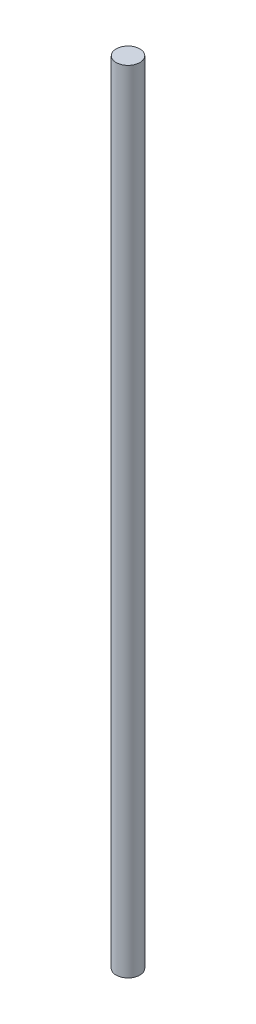
ISO-10303-21;
HEADER;
FILE_DESCRIPTION(('STEP AP214'),'2;1');
FILE_NAME('part.step','',(''),(''),'','','');
FILE_SCHEMA(('AUTOMOTIVE_DESIGN { 1 0 10303 214 1 1 1 1 }'));
ENDSEC;
DATA;
#1=APPLICATION_CONTEXT('core data for automotive mechanical design processes');
#2=APPLICATION_PROTOCOL_DEFINITION('international standard','automotive_design',2000,#1);
#3=PRODUCT_CONTEXT('',#1,'mechanical');
#4=PRODUCT('Part','Part','',(#3));
#5=PRODUCT_RELATED_PRODUCT_CATEGORY('part','',(#4));
#6=PRODUCT_DEFINITION_FORMATION('','',#4);
#7=PRODUCT_DEFINITION_CONTEXT('part definition',#1,'design');
#8=PRODUCT_DEFINITION('design','',#6,#7);
#9=PRODUCT_DEFINITION_SHAPE('','',#8);
#10=(LENGTH_UNIT() NAMED_UNIT(*) SI_UNIT(.MILLI.,.METRE.));
#11=(NAMED_UNIT(*) PLANE_ANGLE_UNIT() SI_UNIT($,.RADIAN.));
#12=(NAMED_UNIT(*) SI_UNIT($,.STERADIAN.) SOLID_ANGLE_UNIT());
#13=UNCERTAINTY_MEASURE_WITH_UNIT(LENGTH_MEASURE(1.E-05),#10,'distance_accuracy_value','');
#14=(GEOMETRIC_REPRESENTATION_CONTEXT(3) GLOBAL_UNCERTAINTY_ASSIGNED_CONTEXT((#13)) GLOBAL_UNIT_ASSIGNED_CONTEXT((#10,
#11,#12)) REPRESENTATION_CONTEXT('',''));
#15=CARTESIAN_POINT('',(0.,0.,0.));
#16=DIRECTION('',(0.,0.,1.));
#17=DIRECTION('',(1.,0.,0.));
#18=AXIS2_PLACEMENT_3D('',#15,#16,#17);
#19=CARTESIAN_POINT('',(0.,400.,0.));
#20=DIRECTION('',(0.,-1.,0.));
#21=DIRECTION('',(0.,0.,-1.));
#22=AXIS2_PLACEMENT_3D('',#19,#20,#21);
#23=CYLINDRICAL_SURFACE('',#22,6.);
#24=CARTESIAN_POINT('',(0.,400.,0.));
#25=DIRECTION('',(0.,1.,0.));
#26=DIRECTION('',(0.,0.,1.));
#27=AXIS2_PLACEMENT_3D('',#24,#25,#26);
#28=CIRCLE('',#27,6.);
#29=CARTESIAN_POINT('',(0.,400.,6.));
#30=VERTEX_POINT('',#29);
#31=EDGE_CURVE('E10',#30,#30,#28,.T.);
#32=ORIENTED_EDGE('',*,*,#31,.F.);
#33=EDGE_LOOP('',(#32));
#34=FACE_BOUND('',#33,.T.);
#35=CARTESIAN_POINT('',(0.,0.,0.));
#36=DIRECTION('',(0.,1.,0.));
#37=DIRECTION('',(0.,0.,1.));
#38=AXIS2_PLACEMENT_3D('',#35,#36,#37);
#39=CIRCLE('',#38,6.);
#40=CARTESIAN_POINT('',(0.,0.,6.));
#41=VERTEX_POINT('',#40);
#42=EDGE_CURVE('E33',#41,#41,#39,.T.);
#43=ORIENTED_EDGE('',*,*,#42,.T.);
#44=EDGE_LOOP('',(#43));
#45=FACE_BOUND('',#44,.T.);
#46=ADVANCED_FACE('F30',(#34,#45),#23,.T.);
#47=CARTESIAN_POINT('',(0.,400.,0.));
#48=DIRECTION('',(0.,1.,0.));
#49=DIRECTION('',(0.,0.,1.));
#50=AXIS2_PLACEMENT_3D('',#47,#48,#49);
#51=PLANE('',#50);
#52=ORIENTED_EDGE('',*,*,#31,.T.);
#53=EDGE_LOOP('',(#52));
#54=FACE_BOUND('',#53,.T.);
#55=ADVANCED_FACE('F45',(#54),#51,.T.);
#56=CARTESIAN_POINT('',(0.,0.,0.));
#57=DIRECTION('',(0.,1.,0.));
#58=DIRECTION('',(0.,0.,1.));
#59=AXIS2_PLACEMENT_3D('',#56,#57,#58);
#60=PLANE('',#59);
#61=ORIENTED_EDGE('',*,*,#42,.F.);
#62=EDGE_LOOP('',(#61));
#63=FACE_BOUND('',#62,.T.);
#64=ADVANCED_FACE('F43',(#63),#60,.F.);
#65=CLOSED_SHELL('',(#46,#55,#64));
#66=MANIFOLD_SOLID_BREP('B2',#65);
#67=ADVANCED_BREP_SHAPE_REPRESENTATION('',(#18,#66),#14);
#68=SHAPE_DEFINITION_REPRESENTATION(#9,#67);
ENDSEC;
END-ISO-10303-21;
